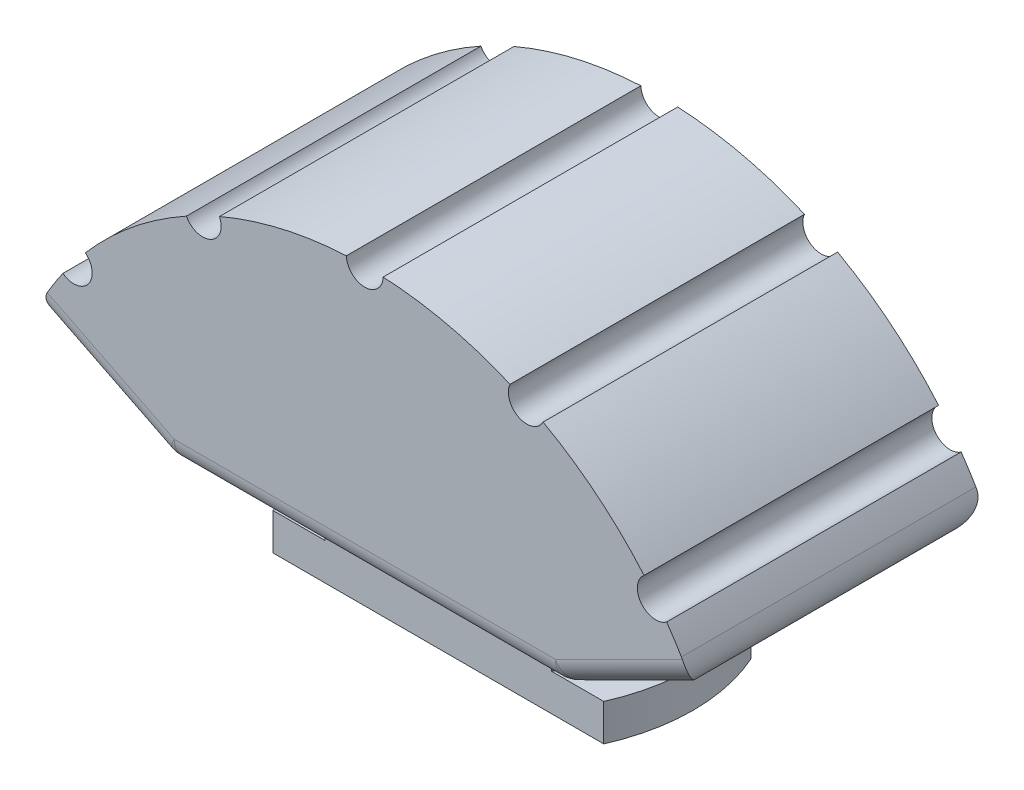
ISO-10303-21;
HEADER;
FILE_DESCRIPTION(('STEP AP214'),'2;1');
FILE_NAME('part.step','',(''),(''),'','','');
FILE_SCHEMA(('AUTOMOTIVE_DESIGN { 1 0 10303 214 1 1 1 1 }'));
ENDSEC;
DATA;
#1=APPLICATION_CONTEXT('core data for automotive mechanical design processes');
#2=APPLICATION_PROTOCOL_DEFINITION('international standard','automotive_design',2000,#1);
#3=PRODUCT_CONTEXT('',#1,'mechanical');
#4=PRODUCT('Part','Part','',(#3));
#5=PRODUCT_RELATED_PRODUCT_CATEGORY('part','',(#4));
#6=PRODUCT_DEFINITION_FORMATION('','',#4);
#7=PRODUCT_DEFINITION_CONTEXT('part definition',#1,'design');
#8=PRODUCT_DEFINITION('design','',#6,#7);
#9=PRODUCT_DEFINITION_SHAPE('','',#8);
#10=(LENGTH_UNIT() NAMED_UNIT(*) SI_UNIT(.MILLI.,.METRE.));
#11=(NAMED_UNIT(*) PLANE_ANGLE_UNIT() SI_UNIT($,.RADIAN.));
#12=(NAMED_UNIT(*) SI_UNIT($,.STERADIAN.) SOLID_ANGLE_UNIT());
#13=UNCERTAINTY_MEASURE_WITH_UNIT(LENGTH_MEASURE(1.E-05),#10,'distance_accuracy_value','');
#14=(GEOMETRIC_REPRESENTATION_CONTEXT(3) GLOBAL_UNCERTAINTY_ASSIGNED_CONTEXT((#13)) GLOBAL_UNIT_ASSIGNED_CONTEXT((#10,
#11,#12)) REPRESENTATION_CONTEXT('',''));
#15=CARTESIAN_POINT('',(0.,0.,0.));
#16=DIRECTION('',(0.,0.,1.));
#17=DIRECTION('',(1.,0.,0.));
#18=AXIS2_PLACEMENT_3D('',#15,#16,#17);
#19=CARTESIAN_POINT('',(0.,3.,0.));
#20=DIRECTION('',(0.,-1.,0.));
#21=DIRECTION('',(0.,0.,-1.));
#22=AXIS2_PLACEMENT_3D('',#19,#20,#21);
#23=PLANE('',#22);
#24=CARTESIAN_POINT('',(0.,3.,0.));
#25=DIRECTION('',(0.,-1.,0.));
#26=DIRECTION('',(0.,0.,-1.));
#27=AXIS2_PLACEMENT_3D('',#24,#25,#26);
#28=CIRCLE('',#27,14.75);
#29=CARTESIAN_POINT('',(13.4745129782119,3.,6.));
#30=VERTEX_POINT('',#29);
#31=CARTESIAN_POINT('',(13.4745129782119,3.,-6.));
#32=VERTEX_POINT('',#31);
#33=EDGE_CURVE('E241',#30,#32,#28,.F.);
#34=ORIENTED_EDGE('',*,*,#33,.T.);
#35=DIRECTION('',(-1.,0.,0.));
#36=VECTOR('',#35,1.);
#37=CARTESIAN_POINT('',(-14.75,3.,-6.));
#38=LINE('',#37,#36);
#39=CARTESIAN_POINT('',(9.21954445729289,3.,-6.));
#40=VERTEX_POINT('',#39);
#41=EDGE_CURVE('E259',#32,#40,#38,.T.);
#42=ORIENTED_EDGE('',*,*,#41,.T.);
#43=CARTESIAN_POINT('',(0.,3.,0.));
#44=DIRECTION('',(0.,1.,0.));
#45=DIRECTION('',(0.,0.,1.));
#46=AXIS2_PLACEMENT_3D('',#43,#44,#45);
#47=CIRCLE('',#46,11.);
#48=CARTESIAN_POINT('',(9.21954445729289,3.,6.));
#49=VERTEX_POINT('',#48);
#50=EDGE_CURVE('E431',#49,#40,#47,.T.);
#51=ORIENTED_EDGE('',*,*,#50,.F.);
#52=DIRECTION('',(1.,0.,0.));
#53=VECTOR('',#52,1.);
#54=CARTESIAN_POINT('',(-14.75,3.,6.));
#55=LINE('',#54,#53);
#56=EDGE_CURVE('E262',#49,#30,#55,.T.);
#57=ORIENTED_EDGE('',*,*,#56,.T.);
#58=EDGE_LOOP('',(#34,#42,#51,#57));
#59=FACE_BOUND('',#58,.T.);
#60=ADVANCED_FACE('F40',(#59),#23,.F.);
#61=CARTESIAN_POINT('',(-14.75,3.,-6.));
#62=DIRECTION('',(0.,0.,1.));
#63=DIRECTION('',(1.,0.,0.));
#64=AXIS2_PLACEMENT_3D('',#61,#62,#63);
#65=PLANE('',#64);
#66=DIRECTION('',(0.,-1.,0.));
#67=VECTOR('',#66,1.);
#68=CARTESIAN_POINT('',(-13.4745129782119,63.533276032636,-6.));
#69=LINE('',#68,#67);
#70=CARTESIAN_POINT('',(-13.4745129782119,3.,-6.));
#71=VERTEX_POINT('',#70);
#72=CARTESIAN_POINT('',(-13.4745129782119,0.,-6.));
#73=VERTEX_POINT('',#72);
#74=EDGE_CURVE('E55',#71,#73,#69,.T.);
#75=ORIENTED_EDGE('',*,*,#74,.F.);
#76=CARTESIAN_POINT('',(-9.21954445729289,3.,-6.));
#77=VERTEX_POINT('',#76);
#78=EDGE_CURVE('E248',#77,#71,#38,.T.);
#79=ORIENTED_EDGE('',*,*,#78,.F.);
#80=DIRECTION('',(0.,-1.,0.));
#81=VECTOR('',#80,1.);
#82=CARTESIAN_POINT('',(-9.21954445729288,33.0599281722833,-6.00000000000001));
#83=LINE('',#82,#81);
#84=CARTESIAN_POINT('',(-9.21954445729288,8.,-6.00000000000001));
#85=VERTEX_POINT('',#84);
#86=EDGE_CURVE('E430',#85,#77,#83,.T.);
#87=ORIENTED_EDGE('',*,*,#86,.F.);
#88=DIRECTION('',(-1.,0.,0.));
#89=VECTOR('',#88,1.);
#90=CARTESIAN_POINT('',(-9.21954445729289,8.,-6.));
#91=LINE('',#90,#89);
#92=CARTESIAN_POINT('',(9.21954445729289,8.,-6.));
#93=VERTEX_POINT('',#92);
#94=EDGE_CURVE('E437',#93,#85,#91,.T.);
#95=ORIENTED_EDGE('',*,*,#94,.F.);
#96=DIRECTION('',(0.,-1.,0.));
#97=VECTOR('',#96,1.);
#98=CARTESIAN_POINT('',(9.21954445729289,33.0599281722833,-6.));
#99=LINE('',#98,#97);
#100=EDGE_CURVE('E434',#93,#40,#99,.T.);
#101=ORIENTED_EDGE('',*,*,#100,.T.);
#102=ORIENTED_EDGE('',*,*,#41,.F.);
#103=DIRECTION('',(0.,-1.,0.));
#104=VECTOR('',#103,1.);
#105=CARTESIAN_POINT('',(13.4745129782119,63.533276032636,-6.));
#106=LINE('',#105,#104);
#107=CARTESIAN_POINT('',(13.4745129782119,0.,-6.));
#108=VERTEX_POINT('',#107);
#109=EDGE_CURVE('E254',#108,#32,#106,.F.);
#110=ORIENTED_EDGE('',*,*,#109,.F.);
#111=DIRECTION('',(-1.,0.,0.));
#112=VECTOR('',#111,1.);
#113=CARTESIAN_POINT('',(-14.75,0.,-6.));
#114=LINE('',#113,#112);
#115=EDGE_CURVE('E252',#108,#73,#114,.T.);
#116=ORIENTED_EDGE('',*,*,#115,.T.);
#117=EDGE_LOOP('',(#75,#79,#87,#95,#101,#102,#110,#116));
#118=FACE_BOUND('',#117,.T.);
#119=ADVANCED_FACE('F246',(#118),#65,.F.);
#120=CARTESIAN_POINT('',(-14.75,3.,6.));
#121=DIRECTION('',(0.,0.,-1.));
#122=DIRECTION('',(-1.,0.,0.));
#123=AXIS2_PLACEMENT_3D('',#120,#121,#122);
#124=PLANE('',#123);
#125=DIRECTION('',(0.,-1.,0.));
#126=VECTOR('',#125,1.);
#127=CARTESIAN_POINT('',(13.4745129782119,63.533276032636,6.));
#128=LINE('',#127,#126);
#129=CARTESIAN_POINT('',(13.4745129782119,0.,6.));
#130=VERTEX_POINT('',#129);
#131=EDGE_CURVE('E63',#30,#130,#128,.T.);
#132=ORIENTED_EDGE('',*,*,#131,.F.);
#133=ORIENTED_EDGE('',*,*,#56,.F.);
#134=DIRECTION('',(0.,-1.,0.));
#135=VECTOR('',#134,1.);
#136=CARTESIAN_POINT('',(9.21954445729289,33.0599281722833,6.));
#137=LINE('',#136,#135);
#138=CARTESIAN_POINT('',(9.21954445729289,8.,6.));
#139=VERTEX_POINT('',#138);
#140=EDGE_CURVE('E267',#139,#49,#137,.T.);
#141=ORIENTED_EDGE('',*,*,#140,.F.);
#142=DIRECTION('',(1.,0.,0.));
#143=VECTOR('',#142,1.);
#144=CARTESIAN_POINT('',(9.21954445729289,8.,6.));
#145=LINE('',#144,#143);
#146=CARTESIAN_POINT('',(-9.21954445729289,8.,6.));
#147=VERTEX_POINT('',#146);
#148=EDGE_CURVE('E443',#147,#139,#145,.T.);
#149=ORIENTED_EDGE('',*,*,#148,.F.);
#150=DIRECTION('',(0.,-1.,0.));
#151=VECTOR('',#150,1.);
#152=CARTESIAN_POINT('',(-9.21954445729289,33.0599281722833,6.));
#153=LINE('',#152,#151);
#154=CARTESIAN_POINT('',(-9.21954445729289,3.,6.));
#155=VERTEX_POINT('',#154);
#156=EDGE_CURVE('E429',#147,#155,#153,.T.);
#157=ORIENTED_EDGE('',*,*,#156,.T.);
#158=CARTESIAN_POINT('',(-13.4745129782119,3.,6.));
#159=VERTEX_POINT('',#158);
#160=EDGE_CURVE('E269',#159,#155,#55,.T.);
#161=ORIENTED_EDGE('',*,*,#160,.F.);
#162=DIRECTION('',(0.,-1.,0.));
#163=VECTOR('',#162,1.);
#164=CARTESIAN_POINT('',(-13.4745129782119,63.533276032636,6.));
#165=LINE('',#164,#163);
#166=CARTESIAN_POINT('',(-13.4745129782119,0.,6.));
#167=VERTEX_POINT('',#166);
#168=EDGE_CURVE('E237',#167,#159,#165,.F.);
#169=ORIENTED_EDGE('',*,*,#168,.F.);
#170=DIRECTION('',(1.,0.,0.));
#171=VECTOR('',#170,1.);
#172=CARTESIAN_POINT('',(-14.75,0.,6.));
#173=LINE('',#172,#171);
#174=EDGE_CURVE('E260',#167,#130,#173,.T.);
#175=ORIENTED_EDGE('',*,*,#174,.T.);
#176=EDGE_LOOP('',(#132,#133,#141,#149,#157,#161,#169,#175));
#177=FACE_BOUND('',#176,.T.);
#178=ADVANCED_FACE('F451',(#177),#124,.F.);
#179=EDGE_CURVE('E234',#71,#159,#28,.F.);
#180=ORIENTED_EDGE('',*,*,#179,.T.);
#181=ORIENTED_EDGE('',*,*,#160,.T.);
#182=CARTESIAN_POINT('',(0.,3.,0.));
#183=DIRECTION('',(0.,1.,0.));
#184=DIRECTION('',(0.,0.,1.));
#185=AXIS2_PLACEMENT_3D('',#182,#183,#184);
#186=CIRCLE('',#185,11.);
#187=EDGE_CURVE('E258',#77,#155,#186,.T.);
#188=ORIENTED_EDGE('',*,*,#187,.F.);
#189=ORIENTED_EDGE('',*,*,#78,.T.);
#190=EDGE_LOOP('',(#180,#181,#188,#189));
#191=FACE_BOUND('',#190,.T.);
#192=ADVANCED_FACE('F256',(#191),#23,.F.);
#193=CARTESIAN_POINT('',(0.,0.,0.));
#194=DIRECTION('',(0.,-1.,0.));
#195=DIRECTION('',(0.,0.,-1.));
#196=AXIS2_PLACEMENT_3D('',#193,#194,#195);
#197=PLANE('',#196);
#198=ORIENTED_EDGE('',*,*,#115,.F.);
#199=CARTESIAN_POINT('',(0.,0.,0.));
#200=DIRECTION('',(0.,-1.,0.));
#201=DIRECTION('',(0.,0.,-1.));
#202=AXIS2_PLACEMENT_3D('',#199,#200,#201);
#203=CIRCLE('',#202,14.75);
#204=EDGE_CURVE('E12',#108,#130,#203,.T.);
#205=ORIENTED_EDGE('',*,*,#204,.T.);
#206=ORIENTED_EDGE('',*,*,#174,.F.);
#207=EDGE_CURVE('E44',#167,#73,#203,.T.);
#208=ORIENTED_EDGE('',*,*,#207,.T.);
#209=EDGE_LOOP('',(#198,#205,#206,#208));
#210=FACE_BOUND('',#209,.T.);
#211=ADVANCED_FACE('F594',(#210),#197,.T.);
#212=CARTESIAN_POINT('',(0.,0.,12.));
#213=DIRECTION('',(0.,0.,-1.));
#214=DIRECTION('',(-1.,0.,0.));
#215=AXIS2_PLACEMENT_3D('',#212,#213,#214);
#216=CYLINDRICAL_SURFACE('',#215,30.);
#217=CARTESIAN_POINT('',(0.,0.,12.));
#218=DIRECTION('',(0.,0.,1.));
#219=DIRECTION('',(1.,0.,0.));
#220=AXIS2_PLACEMENT_3D('',#217,#218,#219);
#221=CIRCLE('',#220,30.);
#222=CARTESIAN_POINT('',(25.8059622884932,15.2987682629964,12.));
#223=VERTEX_POINT('',#222);
#224=CARTESIAN_POINT('',(24.6020989583342,17.1678981487056,12.));
#225=VERTEX_POINT('',#224);
#226=EDGE_CURVE('E421',#223,#225,#221,.T.);
#227=ORIENTED_EDGE('',*,*,#226,.F.);
#228=DIRECTION('',(0.,0.,-1.));
#229=VECTOR('',#228,1.);
#230=CARTESIAN_POINT('',(25.8059622884932,15.2987682629964,12.));
#231=LINE('',#230,#229);
#232=CARTESIAN_POINT('',(25.8059622884932,15.2987682629964,-12.));
#233=VERTEX_POINT('',#232);
#234=EDGE_CURVE('E308',#223,#233,#231,.T.);
#235=ORIENTED_EDGE('',*,*,#234,.T.);
#236=CARTESIAN_POINT('',(0.,0.,-12.));
#237=DIRECTION('',(0.,0.,1.));
#238=DIRECTION('',(1.,0.,0.));
#239=AXIS2_PLACEMENT_3D('',#236,#237,#238);
#240=CIRCLE('',#239,30.);
#241=CARTESIAN_POINT('',(24.6020989583343,17.1678981487056,-12.));
#242=VERTEX_POINT('',#241);
#243=EDGE_CURVE('E425',#233,#242,#240,.T.);
#244=ORIENTED_EDGE('',*,*,#243,.T.);
#245=DIRECTION('',(0.,0.,-1.));
#246=VECTOR('',#245,1.);
#247=CARTESIAN_POINT('',(24.6020989583342,17.1678981487056,0.));
#248=LINE('',#247,#246);
#249=EDGE_CURVE('E417',#242,#225,#248,.F.);
#250=ORIENTED_EDGE('',*,*,#249,.T.);
#251=EDGE_LOOP('',(#227,#235,#244,#250));
#252=FACE_BOUND('',#251,.T.);
#253=ADVANCED_FACE('F539',(#252),#216,.T.);
#254=CARTESIAN_POINT('',(22.765057427445,19.5384789665197,12.));
#255=VERTEX_POINT('',#254);
#256=CARTESIAN_POINT('',(14.534415470196,26.2440615557068,12.));
#257=VERTEX_POINT('',#256);
#258=EDGE_CURVE('E423',#255,#257,#221,.T.);
#259=ORIENTED_EDGE('',*,*,#258,.F.);
#260=DIRECTION('',(0.,0.,-1.));
#261=VECTOR('',#260,1.);
#262=CARTESIAN_POINT('',(22.765057427445,19.5384789665197,0.));
#263=LINE('',#262,#261);
#264=CARTESIAN_POINT('',(22.765057427445,19.5384789665197,-12.));
#265=VERTEX_POINT('',#264);
#266=EDGE_CURVE('E414',#255,#265,#263,.T.);
#267=ORIENTED_EDGE('',*,*,#266,.T.);
#268=CARTESIAN_POINT('',(14.5344154701961,26.2440615557067,-12.));
#269=VERTEX_POINT('',#268);
#270=EDGE_CURVE('E427',#265,#269,#240,.T.);
#271=ORIENTED_EDGE('',*,*,#270,.T.);
#272=DIRECTION('',(0.,0.,-1.));
#273=VECTOR('',#272,1.);
#274=CARTESIAN_POINT('',(14.534415470196,26.2440615557068,0.));
#275=LINE('',#274,#273);
#276=EDGE_CURVE('E411',#269,#257,#275,.F.);
#277=ORIENTED_EDGE('',*,*,#276,.T.);
#278=EDGE_LOOP('',(#259,#267,#271,#277));
#279=FACE_BOUND('',#278,.T.);
#280=ADVANCED_FACE('F659',(#279),#216,.T.);
#281=CARTESIAN_POINT('',(11.8414823948068,27.5640943020713,12.));
#282=VERTEX_POINT('',#281);
#283=CARTESIAN_POINT('',(1.49953117673492,29.9625,12.));
#284=VERTEX_POINT('',#283);
#285=EDGE_CURVE('E494',#282,#284,#221,.T.);
#286=ORIENTED_EDGE('',*,*,#285,.F.);
#287=DIRECTION('',(0.,0.,-1.));
#288=VECTOR('',#287,1.);
#289=CARTESIAN_POINT('',(11.8414823948068,27.5640943020713,0.));
#290=LINE('',#289,#288);
#291=CARTESIAN_POINT('',(11.8414823948068,27.5640943020713,-12.));
#292=VERTEX_POINT('',#291);
#293=EDGE_CURVE('E408',#282,#292,#290,.T.);
#294=ORIENTED_EDGE('',*,*,#293,.T.);
#295=CARTESIAN_POINT('',(1.49953117673497,29.9625,-12.));
#296=VERTEX_POINT('',#295);
#297=EDGE_CURVE('E550',#292,#296,#240,.T.);
#298=ORIENTED_EDGE('',*,*,#297,.T.);
#299=DIRECTION('',(0.,0.,-1.));
#300=VECTOR('',#299,1.);
#301=CARTESIAN_POINT('',(1.49953117673492,29.9625,0.));
#302=LINE('',#301,#300);
#303=EDGE_CURVE('E405',#296,#284,#302,.F.);
#304=ORIENTED_EDGE('',*,*,#303,.T.);
#305=EDGE_LOOP('',(#286,#294,#298,#304));
#306=FACE_BOUND('',#305,.T.);
#307=ADVANCED_FACE('F655',(#306),#216,.T.);
#308=CARTESIAN_POINT('',(-1.49953117673492,29.9625,12.));
#309=VERTEX_POINT('',#308);
#310=CARTESIAN_POINT('',(-11.8414823948069,27.5640943020713,12.));
#311=VERTEX_POINT('',#310);
#312=EDGE_CURVE('E489',#309,#311,#221,.T.);
#313=ORIENTED_EDGE('',*,*,#312,.F.);
#314=DIRECTION('',(0.,0.,-1.));
#315=VECTOR('',#314,1.);
#316=CARTESIAN_POINT('',(-1.49953117673492,29.9625,0.));
#317=LINE('',#316,#315);
#318=CARTESIAN_POINT('',(-1.49953117673492,29.9625,-12.));
#319=VERTEX_POINT('',#318);
#320=EDGE_CURVE('E402',#309,#319,#317,.T.);
#321=ORIENTED_EDGE('',*,*,#320,.T.);
#322=CARTESIAN_POINT('',(-11.8414823948069,27.5640943020713,-12.));
#323=VERTEX_POINT('',#322);
#324=EDGE_CURVE('E552',#319,#323,#240,.T.);
#325=ORIENTED_EDGE('',*,*,#324,.T.);
#326=DIRECTION('',(0.,0.,-1.));
#327=VECTOR('',#326,1.);
#328=CARTESIAN_POINT('',(-11.8414823948069,27.5640943020713,0.));
#329=LINE('',#328,#327);
#330=EDGE_CURVE('E399',#323,#311,#329,.F.);
#331=ORIENTED_EDGE('',*,*,#330,.T.);
#332=EDGE_LOOP('',(#313,#321,#325,#331));
#333=FACE_BOUND('',#332,.T.);
#334=ADVANCED_FACE('F651',(#333),#216,.T.);
#335=CARTESIAN_POINT('',(-14.5344154701962,26.2440615557067,12.));
#336=VERTEX_POINT('',#335);
#337=CARTESIAN_POINT('',(-22.7650574274453,19.5384789665193,12.));
#338=VERTEX_POINT('',#337);
#339=EDGE_CURVE('E487',#336,#338,#221,.T.);
#340=ORIENTED_EDGE('',*,*,#339,.F.);
#341=DIRECTION('',(0.,0.,-1.));
#342=VECTOR('',#341,1.);
#343=CARTESIAN_POINT('',(-14.5344154701962,26.2440615557067,0.));
#344=LINE('',#343,#342);
#345=CARTESIAN_POINT('',(-14.5344154701962,26.2440615557067,-12.));
#346=VERTEX_POINT('',#345);
#347=EDGE_CURVE('E396',#336,#346,#344,.T.);
#348=ORIENTED_EDGE('',*,*,#347,.T.);
#349=CARTESIAN_POINT('',(-22.7650574274453,19.5384789665193,-12.));
#350=VERTEX_POINT('',#349);
#351=EDGE_CURVE('E555',#346,#350,#240,.T.);
#352=ORIENTED_EDGE('',*,*,#351,.T.);
#353=DIRECTION('',(0.,0.,-1.));
#354=VECTOR('',#353,1.);
#355=CARTESIAN_POINT('',(-22.7650574274453,19.5384789665193,0.));
#356=LINE('',#355,#354);
#357=EDGE_CURVE('E392',#350,#338,#356,.F.);
#358=ORIENTED_EDGE('',*,*,#357,.T.);
#359=EDGE_LOOP('',(#340,#348,#352,#358));
#360=FACE_BOUND('',#359,.T.);
#361=ADVANCED_FACE('F491',(#360),#216,.T.);
#362=CARTESIAN_POINT('',(0.,33.0599281722833,0.));
#363=DIRECTION('',(0.,-1.,0.));
#364=DIRECTION('',(0.,0.,-1.));
#365=AXIS2_PLACEMENT_3D('',#362,#363,#364);
#366=CYLINDRICAL_SURFACE('',#365,11.);
#367=CARTESIAN_POINT('',(0.,8.,0.));
#368=DIRECTION('',(0.,1.,0.));
#369=DIRECTION('',(0.,0.,1.));
#370=AXIS2_PLACEMENT_3D('',#367,#368,#369);
#371=CIRCLE('',#370,11.);
#372=EDGE_CURVE('E440',#139,#93,#371,.T.);
#373=ORIENTED_EDGE('',*,*,#372,.F.);
#374=ORIENTED_EDGE('',*,*,#140,.T.);
#375=ORIENTED_EDGE('',*,*,#50,.T.);
#376=ORIENTED_EDGE('',*,*,#100,.F.);
#377=EDGE_LOOP('',(#373,#374,#375,#376));
#378=FACE_BOUND('',#377,.T.);
#379=ADVANCED_FACE('F460',(#378),#366,.T.);
#380=CARTESIAN_POINT('',(0.,33.0599281722833,0.));
#381=DIRECTION('',(0.,-1.,0.));
#382=DIRECTION('',(0.,0.,-1.));
#383=AXIS2_PLACEMENT_3D('',#380,#381,#382);
#384=CYLINDRICAL_SURFACE('',#383,11.);
#385=CARTESIAN_POINT('',(0.,8.,0.));
#386=DIRECTION('',(0.,1.,0.));
#387=DIRECTION('',(0.,0.,1.));
#388=AXIS2_PLACEMENT_3D('',#385,#386,#387);
#389=CIRCLE('',#388,11.);
#390=EDGE_CURVE('E272',#85,#147,#389,.T.);
#391=ORIENTED_EDGE('',*,*,#390,.F.);
#392=ORIENTED_EDGE('',*,*,#86,.T.);
#393=ORIENTED_EDGE('',*,*,#187,.T.);
#394=ORIENTED_EDGE('',*,*,#156,.F.);
#395=EDGE_LOOP('',(#391,#392,#393,#394));
#396=FACE_BOUND('',#395,.T.);
#397=ADVANCED_FACE('F453',(#396),#384,.T.);
#398=CARTESIAN_POINT('',(-24.6020989583345,17.1678981487052,-12.));
#399=VERTEX_POINT('',#398);
#400=CARTESIAN_POINT('',(-25.8059622884932,15.2987682629964,-12.));
#401=VERTEX_POINT('',#400);
#402=EDGE_CURVE('E420',#399,#401,#240,.T.);
#403=ORIENTED_EDGE('',*,*,#402,.T.);
#404=DIRECTION('',(0.,0.,-1.));
#405=VECTOR('',#404,1.);
#406=CARTESIAN_POINT('',(-25.8059622884932,15.2987682629964,12.));
#407=LINE('',#406,#405);
#408=CARTESIAN_POINT('',(-25.8059622884932,15.2987682629964,12.));
#409=VERTEX_POINT('',#408);
#410=EDGE_CURVE('E329',#401,#409,#407,.F.);
#411=ORIENTED_EDGE('',*,*,#410,.T.);
#412=CARTESIAN_POINT('',(-24.6020989583345,17.1678981487052,12.));
#413=VERTEX_POINT('',#412);
#414=EDGE_CURVE('E424',#413,#409,#221,.T.);
#415=ORIENTED_EDGE('',*,*,#414,.F.);
#416=DIRECTION('',(0.,0.,-1.));
#417=VECTOR('',#416,1.);
#418=CARTESIAN_POINT('',(-24.6020989583345,17.1678981487052,0.));
#419=LINE('',#418,#417);
#420=EDGE_CURVE('E390',#413,#399,#419,.T.);
#421=ORIENTED_EDGE('',*,*,#420,.T.);
#422=EDGE_LOOP('',(#403,#411,#415,#421));
#423=FACE_BOUND('',#422,.T.);
#424=ADVANCED_FACE('F560',(#423),#216,.T.);
#425=CARTESIAN_POINT('',(-26.8328157299975,13.4164078649987,12.));
#426=DIRECTION('',(0.447213595499958,0.894427190999916,0.));
#427=DIRECTION('',(-0.894427190999916,0.447213595499958,0.));
#428=AXIS2_PLACEMENT_3D('',#425,#426,#427);
#429=PLANE('',#428);
#430=DIRECTION('',(0.894427190999916,-0.447213595499958,0.));
#431=VECTOR('',#430,1.);
#432=CARTESIAN_POINT('',(-26.8328157299975,13.4164078649988,10.));
#433=LINE('',#432,#431);
#434=CARTESIAN_POINT('',(-16.4222912360003,8.21114561800017,10.));
#435=VERTEX_POINT('',#434);
#436=CARTESIAN_POINT('',(-24.9799919935936,12.4899959967968,10.));
#437=VERTEX_POINT('',#436);
#438=EDGE_CURVE('E324',#435,#437,#433,.F.);
#439=ORIENTED_EDGE('',*,*,#438,.T.);
#440=DIRECTION('',(0.,0.,-1.));
#441=VECTOR('',#440,1.);
#442=CARTESIAN_POINT('',(-24.9799919935936,12.4899959967968,12.));
#443=LINE('',#442,#441);
#444=CARTESIAN_POINT('',(-24.9799919935936,12.4899959967968,-10.));
#445=VERTEX_POINT('',#444);
#446=EDGE_CURVE('E326',#437,#445,#443,.T.);
#447=ORIENTED_EDGE('',*,*,#446,.T.);
#448=DIRECTION('',(0.894427190999916,-0.447213595499958,0.));
#449=VECTOR('',#448,1.);
#450=CARTESIAN_POINT('',(-26.8328157299975,13.4164078649987,-10.));
#451=LINE('',#450,#449);
#452=CARTESIAN_POINT('',(-16.4222912360003,8.21114561800017,-10.));
#453=VERTEX_POINT('',#452);
#454=EDGE_CURVE('E320',#445,#453,#451,.T.);
#455=ORIENTED_EDGE('',*,*,#454,.T.);
#456=DIRECTION('',(0.,0.,-1.));
#457=VECTOR('',#456,1.);
#458=CARTESIAN_POINT('',(-16.4222912360003,8.21114561800017,12.));
#459=LINE('',#458,#457);
#460=EDGE_CURVE('E322',#453,#435,#459,.F.);
#461=ORIENTED_EDGE('',*,*,#460,.T.);
#462=EDGE_LOOP('',(#439,#447,#455,#461));
#463=FACE_BOUND('',#462,.T.);
#464=ADVANCED_FACE('F567',(#463),#429,.F.);
#465=CARTESIAN_POINT('',(-16.,8.,12.));
#466=DIRECTION('',(0.,1.,0.));
#467=DIRECTION('',(0.,0.,1.));
#468=AXIS2_PLACEMENT_3D('',#465,#466,#467);
#469=PLANE('',#468);
#470=DIRECTION('',(0.,0.,-1.));
#471=VECTOR('',#470,1.);
#472=CARTESIAN_POINT('',(-15.5278640450004,8.,12.));
#473=LINE('',#472,#471);
#474=CARTESIAN_POINT('',(-15.5278640450004,8.,10.));
#475=VERTEX_POINT('',#474);
#476=CARTESIAN_POINT('',(-15.5278640450004,8.,-10.));
#477=VERTEX_POINT('',#476);
#478=EDGE_CURVE('E290',#475,#477,#473,.T.);
#479=ORIENTED_EDGE('',*,*,#478,.T.);
#480=DIRECTION('',(1.,0.,0.));
#481=VECTOR('',#480,1.);
#482=CARTESIAN_POINT('',(-16.,8.,-10.));
#483=LINE('',#482,#481);
#484=CARTESIAN_POINT('',(15.5278640450004,8.,-10.));
#485=VERTEX_POINT('',#484);
#486=EDGE_CURVE('E295',#477,#485,#483,.T.);
#487=ORIENTED_EDGE('',*,*,#486,.T.);
#488=DIRECTION('',(0.,0.,-1.));
#489=VECTOR('',#488,1.);
#490=CARTESIAN_POINT('',(15.5278640450004,8.,12.));
#491=LINE('',#490,#489);
#492=CARTESIAN_POINT('',(15.5278640450004,8.,10.));
#493=VERTEX_POINT('',#492);
#494=EDGE_CURVE('E292',#485,#493,#491,.F.);
#495=ORIENTED_EDGE('',*,*,#494,.T.);
#496=DIRECTION('',(1.,0.,0.));
#497=VECTOR('',#496,1.);
#498=CARTESIAN_POINT('',(-16.,8.,10.));
#499=LINE('',#498,#497);
#500=EDGE_CURVE('E288',#493,#475,#499,.F.);
#501=ORIENTED_EDGE('',*,*,#500,.T.);
#502=EDGE_LOOP('',(#479,#487,#495,#501));
#503=FACE_BOUND('',#502,.T.);
#504=ORIENTED_EDGE('',*,*,#390,.T.);
#505=ORIENTED_EDGE('',*,*,#148,.T.);
#506=ORIENTED_EDGE('',*,*,#372,.T.);
#507=ORIENTED_EDGE('',*,*,#94,.T.);
#508=EDGE_LOOP('',(#504,#505,#506,#507));
#509=FACE_BOUND('',#508,.T.);
#510=ADVANCED_FACE('F456',(#503,#509),#469,.F.);
#511=CARTESIAN_POINT('',(16.,8.,12.));
#512=DIRECTION('',(-0.447213595499958,0.894427190999916,0.));
#513=DIRECTION('',(-0.894427190999916,-0.447213595499958,0.));
#514=AXIS2_PLACEMENT_3D('',#511,#512,#513);
#515=PLANE('',#514);
#516=DIRECTION('',(0.894427190999916,0.447213595499958,0.));
#517=VECTOR('',#516,1.);
#518=CARTESIAN_POINT('',(16.,8.,10.));
#519=LINE('',#518,#517);
#520=CARTESIAN_POINT('',(24.9799919935936,12.4899959967968,10.));
#521=VERTEX_POINT('',#520);
#522=CARTESIAN_POINT('',(16.4222912360003,8.21114561800017,10.));
#523=VERTEX_POINT('',#522);
#524=EDGE_CURVE('E283',#521,#523,#519,.F.);
#525=ORIENTED_EDGE('',*,*,#524,.T.);
#526=DIRECTION('',(0.,0.,-1.));
#527=VECTOR('',#526,1.);
#528=CARTESIAN_POINT('',(16.4222912360003,8.21114561800017,12.));
#529=LINE('',#528,#527);
#530=CARTESIAN_POINT('',(16.4222912360003,8.21114561800017,-10.));
#531=VERTEX_POINT('',#530);
#532=EDGE_CURVE('E285',#523,#531,#529,.T.);
#533=ORIENTED_EDGE('',*,*,#532,.T.);
#534=DIRECTION('',(0.894427190999916,0.447213595499958,0.));
#535=VECTOR('',#534,1.);
#536=CARTESIAN_POINT('',(16.,8.,-10.));
#537=LINE('',#536,#535);
#538=CARTESIAN_POINT('',(24.9799919935936,12.4899959967968,-10.));
#539=VERTEX_POINT('',#538);
#540=EDGE_CURVE('E279',#531,#539,#537,.T.);
#541=ORIENTED_EDGE('',*,*,#540,.T.);
#542=DIRECTION('',(0.,0.,-1.));
#543=VECTOR('',#542,1.);
#544=CARTESIAN_POINT('',(24.9799919935936,12.4899959967968,12.));
#545=LINE('',#544,#543);
#546=EDGE_CURVE('E281',#539,#521,#545,.F.);
#547=ORIENTED_EDGE('',*,*,#546,.T.);
#548=EDGE_LOOP('',(#525,#533,#541,#547));
#549=FACE_BOUND('',#548,.T.);
#550=ADVANCED_FACE('F528',(#549),#515,.F.);
#551=CARTESIAN_POINT('',(0.,0.,12.));
#552=DIRECTION('',(0.,0.,1.));
#553=DIRECTION('',(1.,0.,0.));
#554=AXIS2_PLACEMENT_3D('',#551,#552,#553);
#555=PLANE('',#554);
#556=DIRECTION('',(0.894427190999916,0.447213595499958,0.));
#557=VECTOR('',#556,1.);
#558=CARTESIAN_POINT('',(25.9383885389976,15.2052622469986,12.));
#559=LINE('',#558,#557);
#560=CARTESIAN_POINT('',(15.5278640450004,10.,12.));
#561=VERTEX_POINT('',#560);
#562=CARTESIAN_POINT('',(25.8744191845935,15.1732775697966,12.));
#563=VERTEX_POINT('',#562);
#564=EDGE_CURVE('E303',#561,#563,#559,.T.);
#565=ORIENTED_EDGE('',*,*,#564,.T.);
#566=CARTESIAN_POINT('',(24.0855648025937,14.2788503787966,12.));
#567=DIRECTION('',(0.,0.,1.));
#568=DIRECTION('',(1.,0.,0.));
#569=AXIS2_PLACEMENT_3D('',#566,#567,#568);
#570=CIRCLE('',#569,2.);
#571=EDGE_CURVE('E306',#563,#223,#570,.T.);
#572=ORIENTED_EDGE('',*,*,#571,.T.);
#573=ORIENTED_EDGE('',*,*,#226,.T.);
#574=CARTESIAN_POINT('',(23.7132197175365,18.3761587560577,12.));
#575=DIRECTION('',(0.,0.,1.));
#576=DIRECTION('',(1.,0.,0.));
#577=AXIS2_PLACEMENT_3D('',#574,#575,#576);
#578=CIRCLE('',#577,1.5);
#579=EDGE_CURVE('E393',#225,#255,#578,.F.);
#580=ORIENTED_EDGE('',*,*,#579,.T.);
#581=ORIENTED_EDGE('',*,*,#258,.T.);
#582=CARTESIAN_POINT('',(13.2044545006273,26.9377501165349,12.));
#583=DIRECTION('',(0.,0.,1.));
#584=DIRECTION('',(1.,0.,0.));
#585=AXIS2_PLACEMENT_3D('',#582,#583,#584);
#586=CIRCLE('',#585,1.5);
#587=EDGE_CURVE('E472',#257,#282,#586,.F.);
#588=ORIENTED_EDGE('',*,*,#587,.T.);
#589=ORIENTED_EDGE('',*,*,#285,.T.);
#590=CARTESIAN_POINT('',(0.,30.,12.));
#591=DIRECTION('',(0.,0.,1.));
#592=DIRECTION('',(1.,0.,0.));
#593=AXIS2_PLACEMENT_3D('',#590,#591,#592);
#594=CIRCLE('',#593,1.5);
#595=EDGE_CURVE('E475',#284,#309,#594,.F.);
#596=ORIENTED_EDGE('',*,*,#595,.T.);
#597=ORIENTED_EDGE('',*,*,#312,.T.);
#598=CARTESIAN_POINT('',(-13.2044545006271,26.9377501165343,12.));
#599=DIRECTION('',(0.,0.,1.));
#600=DIRECTION('',(1.,0.,0.));
#601=AXIS2_PLACEMENT_3D('',#598,#599,#600);
#602=CIRCLE('',#601,1.5);
#603=EDGE_CURVE('E387',#311,#336,#602,.F.);
#604=ORIENTED_EDGE('',*,*,#603,.T.);
#605=ORIENTED_EDGE('',*,*,#339,.T.);
#606=CARTESIAN_POINT('',(-23.713219717536,18.3761587560567,12.));
#607=DIRECTION('',(0.,0.,1.));
#608=DIRECTION('',(1.,0.,0.));
#609=AXIS2_PLACEMENT_3D('',#606,#607,#608);
#610=CIRCLE('',#609,1.5);
#611=EDGE_CURVE('E378',#338,#413,#610,.F.);
#612=ORIENTED_EDGE('',*,*,#611,.T.);
#613=ORIENTED_EDGE('',*,*,#414,.T.);
#614=CARTESIAN_POINT('',(-24.0855648025937,14.2788503787966,12.));
#615=DIRECTION('',(0.,0.,1.));
#616=DIRECTION('',(1.,0.,0.));
#617=AXIS2_PLACEMENT_3D('',#614,#615,#616);
#618=CIRCLE('',#617,2.);
#619=CARTESIAN_POINT('',(-25.8744191845935,15.1732775697966,12.));
#620=VERTEX_POINT('',#619);
#621=EDGE_CURVE('E301',#409,#620,#618,.T.);
#622=ORIENTED_EDGE('',*,*,#621,.T.);
#623=DIRECTION('',(0.894427190999916,-0.447213595499958,0.));
#624=VECTOR('',#623,1.);
#625=CARTESIAN_POINT('',(-15.1055728090001,9.78885438199983,12.));
#626=LINE('',#625,#624);
#627=CARTESIAN_POINT('',(-15.5278640450004,10.,12.));
#628=VERTEX_POINT('',#627);
#629=EDGE_CURVE('E299',#620,#628,#626,.T.);
#630=ORIENTED_EDGE('',*,*,#629,.T.);
#631=DIRECTION('',(1.,0.,0.));
#632=VECTOR('',#631,1.);
#633=CARTESIAN_POINT('',(16.,10.,12.));
#634=LINE('',#633,#632);
#635=EDGE_CURVE('E297',#628,#561,#634,.T.);
#636=ORIENTED_EDGE('',*,*,#635,.T.);
#637=EDGE_LOOP('',(#565,#572,#573,#580,#581,#588,#589,#596,#597,#604,#605,#612,#613,#622,#630,#636));
#638=FACE_BOUND('',#637,.T.);
#639=ADVANCED_FACE('F486',(#638),#555,.T.);
#640=CARTESIAN_POINT('',(0.,0.,-12.));
#641=DIRECTION('',(0.,0.,1.));
#642=DIRECTION('',(1.,0.,0.));
#643=AXIS2_PLACEMENT_3D('',#640,#641,#642);
#644=PLANE('',#643);
#645=ORIENTED_EDGE('',*,*,#243,.F.);
#646=CARTESIAN_POINT('',(24.0855648025937,14.2788503787966,-12.));
#647=DIRECTION('',(0.,0.,1.));
#648=DIRECTION('',(1.,0.,0.));
#649=AXIS2_PLACEMENT_3D('',#646,#647,#648);
#650=CIRCLE('',#649,2.);
#651=CARTESIAN_POINT('',(25.8744191845935,15.1732775697966,-12.));
#652=VERTEX_POINT('',#651);
#653=EDGE_CURVE('E318',#233,#652,#650,.F.);
#654=ORIENTED_EDGE('',*,*,#653,.T.);
#655=DIRECTION('',(0.894427190999916,0.447213595499958,0.));
#656=VECTOR('',#655,1.);
#657=CARTESIAN_POINT('',(-0.894427190999916,1.78885438199983,-12.));
#658=LINE('',#657,#656);
#659=CARTESIAN_POINT('',(15.5278640450004,10.,-12.));
#660=VERTEX_POINT('',#659);
#661=EDGE_CURVE('E316',#652,#660,#658,.F.);
#662=ORIENTED_EDGE('',*,*,#661,.T.);
#663=DIRECTION('',(1.,0.,0.));
#664=VECTOR('',#663,1.);
#665=CARTESIAN_POINT('',(0.,10.,-12.));
#666=LINE('',#665,#664);
#667=CARTESIAN_POINT('',(-15.5278640450004,10.,-12.));
#668=VERTEX_POINT('',#667);
#669=EDGE_CURVE('E310',#660,#668,#666,.F.);
#670=ORIENTED_EDGE('',*,*,#669,.T.);
#671=DIRECTION('',(0.894427190999916,-0.447213595499958,0.));
#672=VECTOR('',#671,1.);
#673=CARTESIAN_POINT('',(0.894427190999916,1.78885438199983,-12.));
#674=LINE('',#673,#672);
#675=CARTESIAN_POINT('',(-25.8744191845935,15.1732775697966,-12.));
#676=VERTEX_POINT('',#675);
#677=EDGE_CURVE('E312',#668,#676,#674,.F.);
#678=ORIENTED_EDGE('',*,*,#677,.T.);
#679=CARTESIAN_POINT('',(-24.0855648025937,14.2788503787966,-12.));
#680=DIRECTION('',(0.,0.,1.));
#681=DIRECTION('',(1.,0.,0.));
#682=AXIS2_PLACEMENT_3D('',#679,#680,#681);
#683=CIRCLE('',#682,2.);
#684=EDGE_CURVE('E314',#676,#401,#683,.F.);
#685=ORIENTED_EDGE('',*,*,#684,.T.);
#686=ORIENTED_EDGE('',*,*,#402,.F.);
#687=CARTESIAN_POINT('',(-23.713219717536,18.3761587560567,-12.));
#688=DIRECTION('',(0.,0.,-1.));
#689=DIRECTION('',(-1.,0.,0.));
#690=AXIS2_PLACEMENT_3D('',#687,#688,#689);
#691=CIRCLE('',#690,1.5);
#692=EDGE_CURVE('E373',#350,#399,#691,.T.);
#693=ORIENTED_EDGE('',*,*,#692,.F.);
#694=ORIENTED_EDGE('',*,*,#351,.F.);
#695=CARTESIAN_POINT('',(-13.2044545006271,26.9377501165343,-12.));
#696=DIRECTION('',(0.,0.,-1.));
#697=DIRECTION('',(-1.,0.,0.));
#698=AXIS2_PLACEMENT_3D('',#695,#696,#697);
#699=CIRCLE('',#698,1.5);
#700=EDGE_CURVE('E384',#323,#346,#699,.T.);
#701=ORIENTED_EDGE('',*,*,#700,.F.);
#702=ORIENTED_EDGE('',*,*,#324,.F.);
#703=CARTESIAN_POINT('',(0.,30.,-12.));
#704=DIRECTION('',(0.,0.,-1.));
#705=DIRECTION('',(-1.,0.,0.));
#706=AXIS2_PLACEMENT_3D('',#703,#704,#705);
#707=CIRCLE('',#706,1.5);
#708=EDGE_CURVE('E476',#296,#319,#707,.T.);
#709=ORIENTED_EDGE('',*,*,#708,.F.);
#710=ORIENTED_EDGE('',*,*,#297,.F.);
#711=CARTESIAN_POINT('',(13.2044545006273,26.9377501165349,-12.));
#712=DIRECTION('',(0.,0.,1.));
#713=DIRECTION('',(1.,0.,0.));
#714=AXIS2_PLACEMENT_3D('',#711,#712,#713);
#715=CIRCLE('',#714,1.5);
#716=EDGE_CURVE('E271',#292,#269,#715,.T.);
#717=ORIENTED_EDGE('',*,*,#716,.T.);
#718=ORIENTED_EDGE('',*,*,#270,.F.);
#719=CARTESIAN_POINT('',(23.7132197175365,18.3761587560577,-12.));
#720=DIRECTION('',(0.,0.,1.));
#721=DIRECTION('',(1.,0.,0.));
#722=AXIS2_PLACEMENT_3D('',#719,#720,#721);
#723=CIRCLE('',#722,1.5);
#724=EDGE_CURVE('E276',#265,#242,#723,.T.);
#725=ORIENTED_EDGE('',*,*,#724,.T.);
#726=EDGE_LOOP('',(#645,#654,#662,#670,#678,#685,#686,#693,#694,#701,#702,#709,#710,#717,#718,#725));
#727=FACE_BOUND('',#726,.T.);
#728=ADVANCED_FACE('F546',(#727),#644,.F.);
#729=CARTESIAN_POINT('',(-23.713219717536,18.3761587560567,16.2426406871193));
#730=DIRECTION('',(0.,0.,-1.));
#731=DIRECTION('',(-1.,0.,0.));
#732=AXIS2_PLACEMENT_3D('',#729,#730,#731);
#733=CYLINDRICAL_SURFACE('',#732,1.5);
#734=ORIENTED_EDGE('',*,*,#692,.T.);
#735=ORIENTED_EDGE('',*,*,#420,.F.);
#736=ORIENTED_EDGE('',*,*,#611,.F.);
#737=ORIENTED_EDGE('',*,*,#357,.F.);
#738=EDGE_LOOP('',(#734,#735,#736,#737));
#739=FACE_BOUND('',#738,.T.);
#740=ADVANCED_FACE('F682',(#739),#733,.F.);
#741=CARTESIAN_POINT('',(-13.2044545006271,26.9377501165343,16.2426406871193));
#742=DIRECTION('',(0.,0.,-1.));
#743=DIRECTION('',(-1.,0.,0.));
#744=AXIS2_PLACEMENT_3D('',#741,#742,#743);
#745=CYLINDRICAL_SURFACE('',#744,1.5);
#746=ORIENTED_EDGE('',*,*,#700,.T.);
#747=ORIENTED_EDGE('',*,*,#347,.F.);
#748=ORIENTED_EDGE('',*,*,#603,.F.);
#749=ORIENTED_EDGE('',*,*,#330,.F.);
#750=EDGE_LOOP('',(#746,#747,#748,#749));
#751=FACE_BOUND('',#750,.T.);
#752=ADVANCED_FACE('F660',(#751),#745,.F.);
#753=CARTESIAN_POINT('',(0.,30.,16.2426406871193));
#754=DIRECTION('',(0.,0.,-1.));
#755=DIRECTION('',(-1.,0.,0.));
#756=AXIS2_PLACEMENT_3D('',#753,#754,#755);
#757=CYLINDRICAL_SURFACE('',#756,1.5);
#758=ORIENTED_EDGE('',*,*,#708,.T.);
#759=ORIENTED_EDGE('',*,*,#320,.F.);
#760=ORIENTED_EDGE('',*,*,#595,.F.);
#761=ORIENTED_EDGE('',*,*,#303,.F.);
#762=EDGE_LOOP('',(#758,#759,#760,#761));
#763=FACE_BOUND('',#762,.T.);
#764=ADVANCED_FACE('F663',(#763),#757,.F.);
#765=CARTESIAN_POINT('',(13.2044545006273,26.9377501165349,16.2426406871193));
#766=DIRECTION('',(0.,0.,-1.));
#767=DIRECTION('',(-1.,0.,0.));
#768=AXIS2_PLACEMENT_3D('',#765,#766,#767);
#769=CYLINDRICAL_SURFACE('',#768,1.5);
#770=ORIENTED_EDGE('',*,*,#716,.F.);
#771=ORIENTED_EDGE('',*,*,#293,.F.);
#772=ORIENTED_EDGE('',*,*,#587,.F.);
#773=ORIENTED_EDGE('',*,*,#276,.F.);
#774=EDGE_LOOP('',(#770,#771,#772,#773));
#775=FACE_BOUND('',#774,.T.);
#776=ADVANCED_FACE('F669',(#775),#769,.F.);
#777=CARTESIAN_POINT('',(23.7132197175365,18.3761587560577,16.2426406871193));
#778=DIRECTION('',(0.,0.,-1.));
#779=DIRECTION('',(-1.,0.,0.));
#780=AXIS2_PLACEMENT_3D('',#777,#778,#779);
#781=CYLINDRICAL_SURFACE('',#780,1.5);
#782=ORIENTED_EDGE('',*,*,#724,.F.);
#783=ORIENTED_EDGE('',*,*,#266,.F.);
#784=ORIENTED_EDGE('',*,*,#579,.F.);
#785=ORIENTED_EDGE('',*,*,#249,.F.);
#786=EDGE_LOOP('',(#782,#783,#784,#785));
#787=FACE_BOUND('',#786,.T.);
#788=ADVANCED_FACE('F543',(#787),#781,.F.);
#789=CARTESIAN_POINT('',(-24.0855648025937,14.2788503787966,12.));
#790=DIRECTION('',(0.,0.,-1.));
#791=DIRECTION('',(-1.,0.,0.));
#792=AXIS2_PLACEMENT_3D('',#789,#790,#791);
#793=CYLINDRICAL_SURFACE('',#792,2.);
#794=CARTESIAN_POINT('',(-24.0855648025937,14.2788503787966,-10.));
#795=DIRECTION('',(0.632455532033676,-0.316227766016838,-0.707106781186547));
#796=DIRECTION('',(0.632455532033676,-0.316227766016838,0.707106781186547));
#797=AXIS2_PLACEMENT_3D('',#794,#795,#796);
#798=ELLIPSE('',#797,2.82842712474619,2.);
#799=EDGE_CURVE('E369',#445,#676,#798,.T.);
#800=ORIENTED_EDGE('',*,*,#799,.F.);
#801=ORIENTED_EDGE('',*,*,#446,.F.);
#802=CARTESIAN_POINT('',(-24.0855648025937,14.2788503787966,10.));
#803=DIRECTION('',(-0.632455532033676,0.316227766016838,-0.707106781186547));
#804=DIRECTION('',(-0.632455532033676,0.316227766016838,0.707106781186547));
#805=AXIS2_PLACEMENT_3D('',#802,#803,#804);
#806=ELLIPSE('',#805,2.82842712474619,2.);
#807=EDGE_CURVE('E371',#620,#437,#806,.F.);
#808=ORIENTED_EDGE('',*,*,#807,.F.);
#809=ORIENTED_EDGE('',*,*,#621,.F.);
#810=ORIENTED_EDGE('',*,*,#410,.F.);
#811=ORIENTED_EDGE('',*,*,#684,.F.);
#812=EDGE_LOOP('',(#800,#801,#808,#809,#810,#811));
#813=FACE_BOUND('',#812,.T.);
#814=ADVANCED_FACE('F42',(#813),#793,.T.);
#815=CARTESIAN_POINT('',(0.894427190999916,1.78885438199983,10.));
#816=DIRECTION('',(-0.894427190999916,0.447213595499958,0.));
#817=DIRECTION('',(-0.447213595499958,-0.894427190999916,0.));
#818=AXIS2_PLACEMENT_3D('',#815,#816,#817);
#819=CYLINDRICAL_SURFACE('',#818,2.);
#820=ORIENTED_EDGE('',*,*,#807,.T.);
#821=ORIENTED_EDGE('',*,*,#438,.F.);
#822=CARTESIAN_POINT('',(-15.5278640450004,10.,10.));
#823=DIRECTION('',(0.894427190999915,-0.447213595499959,0.));
#824=DIRECTION('',(0.447213595499959,0.894427190999915,0.));
#825=AXIS2_PLACEMENT_3D('',#822,#823,#824);
#826=CIRCLE('',#825,2.);
#827=EDGE_CURVE('E363',#628,#435,#826,.T.);
#828=ORIENTED_EDGE('',*,*,#827,.F.);
#829=ORIENTED_EDGE('',*,*,#629,.F.);
#830=EDGE_LOOP('',(#820,#821,#828,#829));
#831=FACE_BOUND('',#830,.T.);
#832=ADVANCED_FACE('F505',(#831),#819,.T.);
#833=CARTESIAN_POINT('',(-25.9383885389976,15.2052622469986,-10.));
#834=DIRECTION('',(0.894427190999916,-0.447213595499958,0.));
#835=DIRECTION('',(0.447213595499958,0.894427190999916,0.));
#836=AXIS2_PLACEMENT_3D('',#833,#834,#835);
#837=CYLINDRICAL_SURFACE('',#836,2.);
#838=ORIENTED_EDGE('',*,*,#799,.T.);
#839=ORIENTED_EDGE('',*,*,#677,.F.);
#840=CARTESIAN_POINT('',(-15.5278640450004,10.,-10.));
#841=DIRECTION('',(0.894427190999916,-0.447213595499958,0.));
#842=DIRECTION('',(0.447213595499958,0.894427190999916,0.));
#843=AXIS2_PLACEMENT_3D('',#840,#841,#842);
#844=CIRCLE('',#843,2.);
#845=EDGE_CURVE('E360',#453,#668,#844,.T.);
#846=ORIENTED_EDGE('',*,*,#845,.F.);
#847=ORIENTED_EDGE('',*,*,#454,.F.);
#848=EDGE_LOOP('',(#838,#839,#846,#847));
#849=FACE_BOUND('',#848,.T.);
#850=ADVANCED_FACE('F563',(#849),#837,.T.);
#851=CARTESIAN_POINT('',(-15.5278640450004,10.,12.));
#852=DIRECTION('',(0.,0.,-1.));
#853=DIRECTION('',(-1.,0.,0.));
#854=AXIS2_PLACEMENT_3D('',#851,#852,#853);
#855=CYLINDRICAL_SURFACE('',#854,2.);
#856=CARTESIAN_POINT('',(-15.5278640450004,10.,10.));
#857=DIRECTION('',(0.,0.,1.));
#858=DIRECTION('',(1.,0.,0.));
#859=AXIS2_PLACEMENT_3D('',#856,#857,#858);
#860=CIRCLE('',#859,2.);
#861=EDGE_CURVE('E366',#435,#475,#860,.T.);
#862=ORIENTED_EDGE('',*,*,#861,.F.);
#863=ORIENTED_EDGE('',*,*,#460,.F.);
#864=CARTESIAN_POINT('',(-15.5278640450004,10.,-10.));
#865=DIRECTION('',(0.,0.,-1.));
#866=DIRECTION('',(-1.,0.,0.));
#867=AXIS2_PLACEMENT_3D('',#864,#865,#866);
#868=CIRCLE('',#867,2.);
#869=EDGE_CURVE('E357',#477,#453,#868,.T.);
#870=ORIENTED_EDGE('',*,*,#869,.F.);
#871=ORIENTED_EDGE('',*,*,#478,.F.);
#872=EDGE_LOOP('',(#862,#863,#870,#871));
#873=FACE_BOUND('',#872,.T.);
#874=ADVANCED_FACE('F571',(#873),#855,.T.);
#875=CARTESIAN_POINT('',(-15.5278640450004,10.,10.));
#876=DIRECTION('',(0.,0.,1.));
#877=DIRECTION('',(1.,0.,0.));
#878=AXIS2_PLACEMENT_3D('',#875,#876,#877);
#879=SPHERICAL_SURFACE('',#878,2.);
#880=ORIENTED_EDGE('',*,*,#827,.T.);
#881=ORIENTED_EDGE('',*,*,#861,.T.);
#882=CARTESIAN_POINT('',(-15.5278640450004,10.,10.));
#883=DIRECTION('',(-1.,0.,0.));
#884=DIRECTION('',(0.,0.,1.));
#885=AXIS2_PLACEMENT_3D('',#882,#883,#884);
#886=CIRCLE('',#885,2.);
#887=EDGE_CURVE('E354',#628,#475,#886,.F.);
#888=ORIENTED_EDGE('',*,*,#887,.F.);
#889=EDGE_LOOP('',(#880,#881,#888));
#890=FACE_BOUND('',#889,.T.);
#891=ADVANCED_FACE('F575',(#890),#879,.T.);
#892=CARTESIAN_POINT('',(24.0855648025937,14.2788503787966,12.));
#893=DIRECTION('',(0.,0.,-1.));
#894=DIRECTION('',(-1.,0.,0.));
#895=AXIS2_PLACEMENT_3D('',#892,#893,#894);
#896=CYLINDRICAL_SURFACE('',#895,2.);
#897=ORIENTED_EDGE('',*,*,#234,.F.);
#898=ORIENTED_EDGE('',*,*,#571,.F.);
#899=CARTESIAN_POINT('',(24.0855648025937,14.2788503787966,10.));
#900=DIRECTION('',(0.632455532033676,0.316227766016838,-0.707106781186547));
#901=DIRECTION('',(-0.632455532033676,-0.316227766016838,-0.707106781186547));
#902=AXIS2_PLACEMENT_3D('',#899,#900,#901);
#903=ELLIPSE('',#902,2.82842712474619,2.);
#904=EDGE_CURVE('E352',#521,#563,#903,.F.);
#905=ORIENTED_EDGE('',*,*,#904,.F.);
#906=ORIENTED_EDGE('',*,*,#546,.F.);
#907=CARTESIAN_POINT('',(24.0855648025937,14.2788503787966,-10.));
#908=DIRECTION('',(0.632455532033676,0.316227766016838,0.707106781186547));
#909=DIRECTION('',(0.632455532033676,0.316227766016838,-0.707106781186547));
#910=AXIS2_PLACEMENT_3D('',#907,#908,#909);
#911=ELLIPSE('',#910,2.82842712474619,2.);
#912=EDGE_CURVE('E349',#652,#539,#911,.F.);
#913=ORIENTED_EDGE('',*,*,#912,.F.);
#914=ORIENTED_EDGE('',*,*,#653,.F.);
#915=EDGE_LOOP('',(#897,#898,#905,#906,#913,#914));
#916=FACE_BOUND('',#915,.T.);
#917=ADVANCED_FACE('F534',(#916),#896,.T.);
#918=CARTESIAN_POINT('',(-15.5278640450004,10.,-10.));
#919=DIRECTION('',(0.,0.,-1.));
#920=DIRECTION('',(-1.,0.,0.));
#921=AXIS2_PLACEMENT_3D('',#918,#919,#920);
#922=SPHERICAL_SURFACE('',#921,2.);
#923=ORIENTED_EDGE('',*,*,#869,.T.);
#924=ORIENTED_EDGE('',*,*,#845,.T.);
#925=CARTESIAN_POINT('',(-15.5278640450004,10.,-10.));
#926=DIRECTION('',(-1.,0.,0.));
#927=DIRECTION('',(0.,0.,1.));
#928=AXIS2_PLACEMENT_3D('',#925,#926,#927);
#929=CIRCLE('',#928,2.);
#930=EDGE_CURVE('E346',#477,#668,#929,.F.);
#931=ORIENTED_EDGE('',*,*,#930,.F.);
#932=EDGE_LOOP('',(#923,#924,#931));
#933=FACE_BOUND('',#932,.T.);
#934=ADVANCED_FACE('F582',(#933),#922,.T.);
#935=CARTESIAN_POINT('',(0.,10.,10.));
#936=DIRECTION('',(-1.,0.,0.));
#937=DIRECTION('',(0.,0.,1.));
#938=AXIS2_PLACEMENT_3D('',#935,#936,#937);
#939=CYLINDRICAL_SURFACE('',#938,2.);
#940=ORIENTED_EDGE('',*,*,#887,.T.);
#941=ORIENTED_EDGE('',*,*,#500,.F.);
#942=CARTESIAN_POINT('',(15.5278640450004,10.,10.));
#943=DIRECTION('',(1.,0.,0.));
#944=DIRECTION('',(0.,0.,-1.));
#945=AXIS2_PLACEMENT_3D('',#942,#943,#944);
#946=CIRCLE('',#945,2.);
#947=EDGE_CURVE('E343',#561,#493,#946,.T.);
#948=ORIENTED_EDGE('',*,*,#947,.F.);
#949=ORIENTED_EDGE('',*,*,#635,.F.);
#950=EDGE_LOOP('',(#940,#941,#948,#949));
#951=FACE_BOUND('',#950,.T.);
#952=ADVANCED_FACE('F519',(#951),#939,.T.);
#953=CARTESIAN_POINT('',(-0.894427190999916,1.78885438199983,10.));
#954=DIRECTION('',(-0.894427190999916,-0.447213595499958,0.));
#955=DIRECTION('',(0.447213595499958,-0.894427190999916,0.));
#956=AXIS2_PLACEMENT_3D('',#953,#954,#955);
#957=CYLINDRICAL_SURFACE('',#956,2.);
#958=ORIENTED_EDGE('',*,*,#904,.T.);
#959=ORIENTED_EDGE('',*,*,#564,.F.);
#960=CARTESIAN_POINT('',(15.5278640450004,10.,10.));
#961=DIRECTION('',(-0.894427190999916,-0.447213595499958,0.));
#962=DIRECTION('',(0.447213595499958,-0.894427190999916,0.));
#963=AXIS2_PLACEMENT_3D('',#960,#961,#962);
#964=CIRCLE('',#963,2.);
#965=EDGE_CURVE('E340',#523,#561,#964,.T.);
#966=ORIENTED_EDGE('',*,*,#965,.F.);
#967=ORIENTED_EDGE('',*,*,#524,.F.);
#968=EDGE_LOOP('',(#958,#959,#966,#967));
#969=FACE_BOUND('',#968,.T.);
#970=ADVANCED_FACE('F513',(#969),#957,.T.);
#971=CARTESIAN_POINT('',(15.1055728090001,9.78885438199983,-10.));
#972=DIRECTION('',(0.894427190999916,0.447213595499958,0.));
#973=DIRECTION('',(-0.447213595499958,0.894427190999916,0.));
#974=AXIS2_PLACEMENT_3D('',#971,#972,#973);
#975=CYLINDRICAL_SURFACE('',#974,2.);
#976=ORIENTED_EDGE('',*,*,#912,.T.);
#977=ORIENTED_EDGE('',*,*,#540,.F.);
#978=CARTESIAN_POINT('',(15.5278640450004,10.,-10.));
#979=DIRECTION('',(-0.894427190999916,-0.447213595499959,0.));
#980=DIRECTION('',(0.447213595499959,-0.894427190999916,0.));
#981=AXIS2_PLACEMENT_3D('',#978,#979,#980);
#982=CIRCLE('',#981,2.);
#983=EDGE_CURVE('E337',#660,#531,#982,.T.);
#984=ORIENTED_EDGE('',*,*,#983,.F.);
#985=ORIENTED_EDGE('',*,*,#661,.F.);
#986=EDGE_LOOP('',(#976,#977,#984,#985));
#987=FACE_BOUND('',#986,.T.);
#988=ADVANCED_FACE('F615',(#987),#975,.T.);
#989=CARTESIAN_POINT('',(-16.,10.,-10.));
#990=DIRECTION('',(1.,0.,0.));
#991=DIRECTION('',(0.,0.,-1.));
#992=AXIS2_PLACEMENT_3D('',#989,#990,#991);
#993=CYLINDRICAL_SURFACE('',#992,2.);
#994=ORIENTED_EDGE('',*,*,#930,.T.);
#995=ORIENTED_EDGE('',*,*,#669,.F.);
#996=CARTESIAN_POINT('',(15.5278640450004,10.,-10.));
#997=DIRECTION('',(1.,0.,0.));
#998=DIRECTION('',(0.,0.,-1.));
#999=AXIS2_PLACEMENT_3D('',#996,#997,#998);
#1000=CIRCLE('',#999,2.);
#1001=EDGE_CURVE('E334',#485,#660,#1000,.T.);
#1002=ORIENTED_EDGE('',*,*,#1001,.F.);
#1003=ORIENTED_EDGE('',*,*,#486,.F.);
#1004=EDGE_LOOP('',(#994,#995,#1002,#1003));
#1005=FACE_BOUND('',#1004,.T.);
#1006=ADVANCED_FACE('F612',(#1005),#993,.T.);
#1007=CARTESIAN_POINT('',(15.5278640450004,10.,10.));
#1008=DIRECTION('',(0.,0.,1.));
#1009=DIRECTION('',(1.,0.,0.));
#1010=AXIS2_PLACEMENT_3D('',#1007,#1008,#1009);
#1011=SPHERICAL_SURFACE('',#1010,2.);
#1012=ORIENTED_EDGE('',*,*,#965,.T.);
#1013=ORIENTED_EDGE('',*,*,#947,.T.);
#1014=CARTESIAN_POINT('',(15.5278640450004,10.,10.));
#1015=DIRECTION('',(0.,0.,1.));
#1016=DIRECTION('',(1.,0.,0.));
#1017=AXIS2_PLACEMENT_3D('',#1014,#1015,#1016);
#1018=CIRCLE('',#1017,2.);
#1019=EDGE_CURVE('E332',#523,#493,#1018,.F.);
#1020=ORIENTED_EDGE('',*,*,#1019,.F.);
#1021=EDGE_LOOP('',(#1012,#1013,#1020));
#1022=FACE_BOUND('',#1021,.T.);
#1023=ADVANCED_FACE('F521',(#1022),#1011,.T.);
#1024=CARTESIAN_POINT('',(15.5278640450004,10.,-10.));
#1025=DIRECTION('',(0.,0.,-1.));
#1026=DIRECTION('',(-1.,0.,0.));
#1027=AXIS2_PLACEMENT_3D('',#1024,#1025,#1026);
#1028=SPHERICAL_SURFACE('',#1027,2.);
#1029=ORIENTED_EDGE('',*,*,#1001,.T.);
#1030=ORIENTED_EDGE('',*,*,#983,.T.);
#1031=CARTESIAN_POINT('',(15.5278640450004,10.,-10.));
#1032=DIRECTION('',(0.,0.,-1.));
#1033=DIRECTION('',(-1.,0.,0.));
#1034=AXIS2_PLACEMENT_3D('',#1031,#1032,#1033);
#1035=CIRCLE('',#1034,2.);
#1036=EDGE_CURVE('E253',#485,#531,#1035,.F.);
#1037=ORIENTED_EDGE('',*,*,#1036,.F.);
#1038=EDGE_LOOP('',(#1029,#1030,#1037));
#1039=FACE_BOUND('',#1038,.T.);
#1040=ADVANCED_FACE('F606',(#1039),#1028,.T.);
#1041=CARTESIAN_POINT('',(15.5278640450004,10.,12.));
#1042=DIRECTION('',(0.,0.,-1.));
#1043=DIRECTION('',(-1.,0.,0.));
#1044=AXIS2_PLACEMENT_3D('',#1041,#1042,#1043);
#1045=CYLINDRICAL_SURFACE('',#1044,2.);
#1046=ORIENTED_EDGE('',*,*,#1019,.T.);
#1047=ORIENTED_EDGE('',*,*,#494,.F.);
#1048=ORIENTED_EDGE('',*,*,#1036,.T.);
#1049=ORIENTED_EDGE('',*,*,#532,.F.);
#1050=EDGE_LOOP('',(#1046,#1047,#1048,#1049));
#1051=FACE_BOUND('',#1050,.T.);
#1052=ADVANCED_FACE('F525',(#1051),#1045,.T.);
#1053=CARTESIAN_POINT('',(0.,63.533276032636,0.));
#1054=DIRECTION('',(0.,-1.,0.));
#1055=DIRECTION('',(0.,0.,-1.));
#1056=AXIS2_PLACEMENT_3D('',#1053,#1054,#1055);
#1057=CYLINDRICAL_SURFACE('',#1056,14.75);
#1058=ORIENTED_EDGE('',*,*,#74,.T.);
#1059=ORIENTED_EDGE('',*,*,#207,.F.);
#1060=ORIENTED_EDGE('',*,*,#168,.T.);
#1061=ORIENTED_EDGE('',*,*,#179,.F.);
#1062=EDGE_LOOP('',(#1058,#1059,#1060,#1061));
#1063=FACE_BOUND('',#1062,.T.);
#1064=ADVANCED_FACE('F235',(#1063),#1057,.T.);
#1065=ORIENTED_EDGE('',*,*,#33,.F.);
#1066=ORIENTED_EDGE('',*,*,#131,.T.);
#1067=ORIENTED_EDGE('',*,*,#204,.F.);
#1068=ORIENTED_EDGE('',*,*,#109,.T.);
#1069=EDGE_LOOP('',(#1065,#1066,#1067,#1068));
#1070=FACE_BOUND('',#1069,.T.);
#1071=ADVANCED_FACE('F800',(#1070),#1057,.T.);
#1072=CLOSED_SHELL('',(#60,#119,#178,#192,#211,#253,#280,#307,#334,#361,#379,#397,#424,#464,
#510,#550,#639,#728,#740,#752,#764,#776,#788,#814,#832,#850,#874,#891,#917,#934,#952,#970,#988,
#1006,#1023,#1040,#1052,#1064,#1071));
#1073=MANIFOLD_SOLID_BREP('B2',#1072);
#1074=ADVANCED_BREP_SHAPE_REPRESENTATION('',(#18,#1073),#14);
#1075=SHAPE_DEFINITION_REPRESENTATION(#9,#1074);
ENDSEC;
END-ISO-10303-21;
